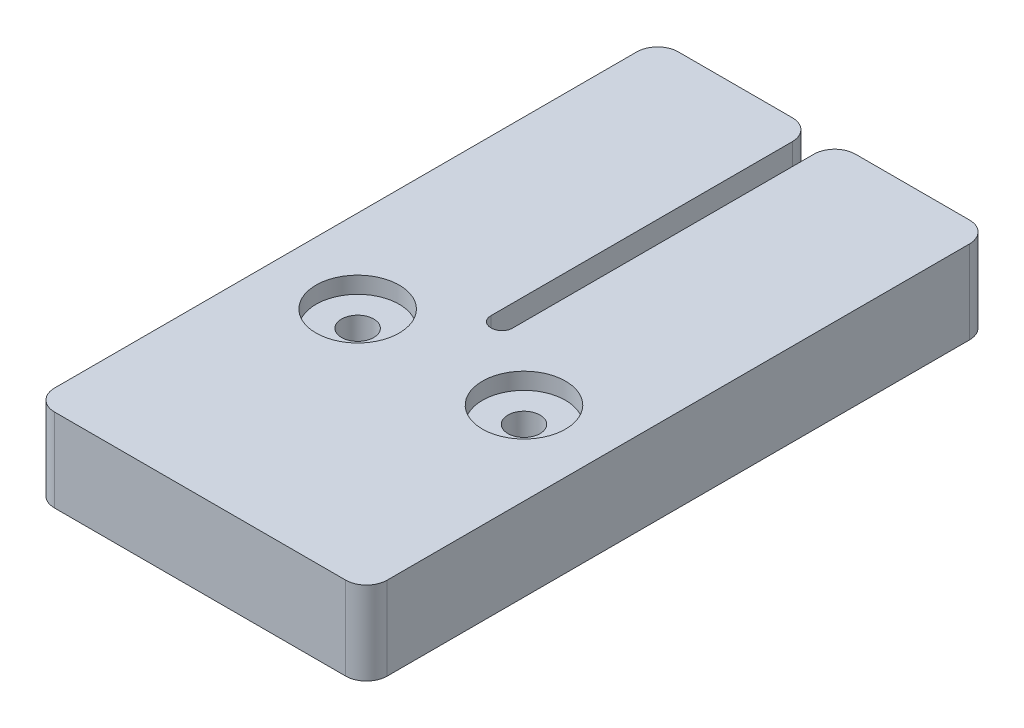
ISO-10303-21;
HEADER;
FILE_DESCRIPTION(('STEP AP214'),'2;1');
FILE_NAME('part.step','',(''),(''),'','','');
FILE_SCHEMA(('AUTOMOTIVE_DESIGN { 1 0 10303 214 1 1 1 1 }'));
ENDSEC;
DATA;
#1=APPLICATION_CONTEXT('core data for automotive mechanical design processes');
#2=APPLICATION_PROTOCOL_DEFINITION('international standard','automotive_design',2000,#1);
#3=PRODUCT_CONTEXT('',#1,'mechanical');
#4=PRODUCT('Part','Part','',(#3));
#5=PRODUCT_RELATED_PRODUCT_CATEGORY('part','',(#4));
#6=PRODUCT_DEFINITION_FORMATION('','',#4);
#7=PRODUCT_DEFINITION_CONTEXT('part definition',#1,'design');
#8=PRODUCT_DEFINITION('design','',#6,#7);
#9=PRODUCT_DEFINITION_SHAPE('','',#8);
#10=(LENGTH_UNIT() NAMED_UNIT(*) SI_UNIT(.MILLI.,.METRE.));
#11=(NAMED_UNIT(*) PLANE_ANGLE_UNIT() SI_UNIT($,.RADIAN.));
#12=(NAMED_UNIT(*) SI_UNIT($,.STERADIAN.) SOLID_ANGLE_UNIT());
#13=UNCERTAINTY_MEASURE_WITH_UNIT(LENGTH_MEASURE(1.E-05),#10,'distance_accuracy_value','');
#14=(GEOMETRIC_REPRESENTATION_CONTEXT(3) GLOBAL_UNCERTAINTY_ASSIGNED_CONTEXT((#13)) GLOBAL_UNIT_ASSIGNED_CONTEXT((#10,
#11,#12)) REPRESENTATION_CONTEXT('',''));
#15=CARTESIAN_POINT('',(0.,0.,0.));
#16=DIRECTION('',(0.,0.,1.));
#17=DIRECTION('',(1.,0.,0.));
#18=AXIS2_PLACEMENT_3D('',#15,#16,#17);
#19=CARTESIAN_POINT('',(12.7,12.7,-36.7538));
#20=DIRECTION('',(0.,-1.,0.));
#21=DIRECTION('',(0.,0.,-1.));
#22=AXIS2_PLACEMENT_3D('',#19,#20,#21);
#23=CYLINDRICAL_SURFACE('',#22,2.45745);
#24=CARTESIAN_POINT('',(12.7,0.,-36.7538));
#25=DIRECTION('',(0.,-1.,0.));
#26=DIRECTION('',(0.,0.,-1.));
#27=AXIS2_PLACEMENT_3D('',#24,#25,#26);
#28=CIRCLE('',#27,2.45745);
#29=CARTESIAN_POINT('',(12.7,0.,-39.21125));
#30=VERTEX_POINT('',#29);
#31=EDGE_CURVE('E294',#30,#30,#28,.T.);
#32=ORIENTED_EDGE('',*,*,#31,.T.);
#33=EDGE_LOOP('',(#32));
#34=FACE_BOUND('',#33,.T.);
#35=CARTESIAN_POINT('',(12.7,10.16,-36.7538));
#36=DIRECTION('',(0.,1.,0.));
#37=DIRECTION('',(0.,0.,1.));
#38=AXIS2_PLACEMENT_3D('',#35,#36,#37);
#39=CIRCLE('',#38,2.45745);
#40=CARTESIAN_POINT('',(12.7,10.16,-34.29635));
#41=VERTEX_POINT('',#40);
#42=EDGE_CURVE('E42',#41,#41,#39,.F.);
#43=ORIENTED_EDGE('',*,*,#42,.F.);
#44=EDGE_LOOP('',(#43));
#45=FACE_BOUND('',#44,.T.);
#46=ADVANCED_FACE('F38',(#34,#45),#23,.F.);
#47=CARTESIAN_POINT('',(-12.7,12.7,-36.7538));
#48=DIRECTION('',(0.,-1.,0.));
#49=DIRECTION('',(0.,0.,-1.));
#50=AXIS2_PLACEMENT_3D('',#47,#48,#49);
#51=CYLINDRICAL_SURFACE('',#50,2.45745);
#52=CARTESIAN_POINT('',(-12.7,0.,-36.7538));
#53=DIRECTION('',(0.,-1.,0.));
#54=DIRECTION('',(0.,0.,-1.));
#55=AXIS2_PLACEMENT_3D('',#52,#53,#54);
#56=CIRCLE('',#55,2.45745);
#57=CARTESIAN_POINT('',(-12.7,0.,-39.21125));
#58=VERTEX_POINT('',#57);
#59=EDGE_CURVE('E313',#58,#58,#56,.T.);
#60=ORIENTED_EDGE('',*,*,#59,.T.);
#61=EDGE_LOOP('',(#60));
#62=FACE_BOUND('',#61,.T.);
#63=CARTESIAN_POINT('',(-12.7,10.16,-36.7538));
#64=DIRECTION('',(0.,1.,0.));
#65=DIRECTION('',(0.,0.,1.));
#66=AXIS2_PLACEMENT_3D('',#63,#64,#65);
#67=CIRCLE('',#66,2.45745);
#68=CARTESIAN_POINT('',(-12.7,10.16,-34.29635));
#69=VERTEX_POINT('',#68);
#70=EDGE_CURVE('E284',#69,#69,#67,.F.);
#71=ORIENTED_EDGE('',*,*,#70,.F.);
#72=EDGE_LOOP('',(#71));
#73=FACE_BOUND('',#72,.T.);
#74=ADVANCED_FACE('F383',(#62,#73),#51,.F.);
#75=CARTESIAN_POINT('',(-25.4,12.7,-95.25));
#76=DIRECTION('',(1.,0.,0.));
#77=DIRECTION('',(0.,0.,-1.));
#78=AXIS2_PLACEMENT_3D('',#75,#76,#77);
#79=PLANE('',#78);
#80=DIRECTION('',(0.,0.,1.));
#81=VECTOR('',#80,1.);
#82=CARTESIAN_POINT('',(-25.4,12.7,-95.25));
#83=LINE('',#82,#81);
#84=CARTESIAN_POINT('',(-25.4,12.7,-92.075));
#85=VERTEX_POINT('',#84);
#86=CARTESIAN_POINT('',(-25.4,12.7,-3.175));
#87=VERTEX_POINT('',#86);
#88=EDGE_CURVE('E193',#85,#87,#83,.T.);
#89=ORIENTED_EDGE('',*,*,#88,.F.);
#90=DIRECTION('',(0.,-1.,0.));
#91=VECTOR('',#90,1.);
#92=CARTESIAN_POINT('',(-25.4,12.7,-92.075));
#93=LINE('',#92,#91);
#94=CARTESIAN_POINT('',(-25.4,0.,-92.075));
#95=VERTEX_POINT('',#94);
#96=EDGE_CURVE('E246',#85,#95,#93,.T.);
#97=ORIENTED_EDGE('',*,*,#96,.T.);
#98=DIRECTION('',(0.,0.,1.));
#99=VECTOR('',#98,1.);
#100=CARTESIAN_POINT('',(-25.4,0.,-95.25));
#101=LINE('',#100,#99);
#102=CARTESIAN_POINT('',(-25.4,0.,-3.175));
#103=VERTEX_POINT('',#102);
#104=EDGE_CURVE('E317',#95,#103,#101,.T.);
#105=ORIENTED_EDGE('',*,*,#104,.T.);
#106=DIRECTION('',(0.,-1.,0.));
#107=VECTOR('',#106,1.);
#108=CARTESIAN_POINT('',(-25.4,12.7,-3.175));
#109=LINE('',#108,#107);
#110=EDGE_CURVE('E243',#103,#87,#109,.F.);
#111=ORIENTED_EDGE('',*,*,#110,.T.);
#112=EDGE_LOOP('',(#89,#97,#105,#111));
#113=FACE_BOUND('',#112,.T.);
#114=ADVANCED_FACE('F389',(#113),#79,.F.);
#115=CARTESIAN_POINT('',(-25.4,12.7,0.));
#116=DIRECTION('',(0.,0.,-1.));
#117=DIRECTION('',(-1.,0.,0.));
#118=AXIS2_PLACEMENT_3D('',#115,#116,#117);
#119=PLANE('',#118);
#120=DIRECTION('',(1.,0.,0.));
#121=VECTOR('',#120,1.);
#122=CARTESIAN_POINT('',(-25.4,12.7,0.));
#123=LINE('',#122,#121);
#124=CARTESIAN_POINT('',(-22.225,12.7,0.));
#125=VERTEX_POINT('',#124);
#126=CARTESIAN_POINT('',(22.225,12.7,0.));
#127=VERTEX_POINT('',#126);
#128=EDGE_CURVE('E324',#125,#127,#123,.T.);
#129=ORIENTED_EDGE('',*,*,#128,.F.);
#130=DIRECTION('',(0.,-1.,0.));
#131=VECTOR('',#130,1.);
#132=CARTESIAN_POINT('',(-22.225,12.7,0.));
#133=LINE('',#132,#131);
#134=CARTESIAN_POINT('',(-22.225,0.,0.));
#135=VERTEX_POINT('',#134);
#136=EDGE_CURVE('E260',#125,#135,#133,.T.);
#137=ORIENTED_EDGE('',*,*,#136,.T.);
#138=DIRECTION('',(1.,0.,0.));
#139=VECTOR('',#138,1.);
#140=CARTESIAN_POINT('',(-25.4,0.,0.));
#141=LINE('',#140,#139);
#142=CARTESIAN_POINT('',(22.225,0.,0.));
#143=VERTEX_POINT('',#142);
#144=EDGE_CURVE('E351',#135,#143,#141,.T.);
#145=ORIENTED_EDGE('',*,*,#144,.T.);
#146=DIRECTION('',(0.,-1.,0.));
#147=VECTOR('',#146,1.);
#148=CARTESIAN_POINT('',(22.225,12.7,0.));
#149=LINE('',#148,#147);
#150=EDGE_CURVE('E257',#143,#127,#149,.F.);
#151=ORIENTED_EDGE('',*,*,#150,.T.);
#152=EDGE_LOOP('',(#129,#137,#145,#151));
#153=FACE_BOUND('',#152,.T.);
#154=ADVANCED_FACE('F380',(#153),#119,.F.);
#155=CARTESIAN_POINT('',(25.4,12.7,0.));
#156=DIRECTION('',(-1.,0.,0.));
#157=DIRECTION('',(0.,0.,1.));
#158=AXIS2_PLACEMENT_3D('',#155,#156,#157);
#159=PLANE('',#158);
#160=DIRECTION('',(0.,0.,-1.));
#161=VECTOR('',#160,1.);
#162=CARTESIAN_POINT('',(25.4,0.,0.));
#163=LINE('',#162,#161);
#164=CARTESIAN_POINT('',(25.4,0.,-3.175));
#165=VERTEX_POINT('',#164);
#166=CARTESIAN_POINT('',(25.4,0.,-92.075));
#167=VERTEX_POINT('',#166);
#168=EDGE_CURVE('E184',#165,#167,#163,.T.);
#169=ORIENTED_EDGE('',*,*,#168,.T.);
#170=DIRECTION('',(0.,-1.,0.));
#171=VECTOR('',#170,1.);
#172=CARTESIAN_POINT('',(25.4,12.7,-92.075));
#173=LINE('',#172,#171);
#174=CARTESIAN_POINT('',(25.4,12.7,-92.075));
#175=VERTEX_POINT('',#174);
#176=EDGE_CURVE('E254',#167,#175,#173,.F.);
#177=ORIENTED_EDGE('',*,*,#176,.T.);
#178=DIRECTION('',(0.,0.,-1.));
#179=VECTOR('',#178,1.);
#180=CARTESIAN_POINT('',(25.4,12.7,0.));
#181=LINE('',#180,#179);
#182=CARTESIAN_POINT('',(25.4,12.7,-3.175));
#183=VERTEX_POINT('',#182);
#184=EDGE_CURVE('E328',#183,#175,#181,.T.);
#185=ORIENTED_EDGE('',*,*,#184,.F.);
#186=DIRECTION('',(0.,-1.,0.));
#187=VECTOR('',#186,1.);
#188=CARTESIAN_POINT('',(25.4,12.7,-3.175));
#189=LINE('',#188,#187);
#190=EDGE_CURVE('E250',#183,#165,#189,.T.);
#191=ORIENTED_EDGE('',*,*,#190,.T.);
#192=EDGE_LOOP('',(#169,#177,#185,#191));
#193=FACE_BOUND('',#192,.T.);
#194=ADVANCED_FACE('F360',(#193),#159,.F.);
#195=CARTESIAN_POINT('',(25.4,12.7,-95.25));
#196=DIRECTION('',(0.,0.,1.));
#197=DIRECTION('',(1.,0.,0.));
#198=AXIS2_PLACEMENT_3D('',#195,#196,#197);
#199=PLANE('',#198);
#200=DIRECTION('',(-1.,0.,0.));
#201=VECTOR('',#200,1.);
#202=CARTESIAN_POINT('',(25.4,0.,-95.25));
#203=LINE('',#202,#201);
#204=CARTESIAN_POINT('',(22.225,0.,-95.25));
#205=VERTEX_POINT('',#204);
#206=CARTESIAN_POINT('',(4.826,0.,-95.25));
#207=VERTEX_POINT('',#206);
#208=EDGE_CURVE('E176',#205,#207,#203,.T.);
#209=ORIENTED_EDGE('',*,*,#208,.T.);
#210=DIRECTION('',(0.,-1.,0.));
#211=VECTOR('',#210,1.);
#212=CARTESIAN_POINT('',(4.826,12.7,-95.25));
#213=LINE('',#212,#211);
#214=CARTESIAN_POINT('',(4.826,12.7,-95.25));
#215=VERTEX_POINT('',#214);
#216=EDGE_CURVE('E159',#207,#215,#213,.F.);
#217=ORIENTED_EDGE('',*,*,#216,.T.);
#218=DIRECTION('',(-1.,0.,0.));
#219=VECTOR('',#218,1.);
#220=CARTESIAN_POINT('',(25.4,12.7,-95.25));
#221=LINE('',#220,#219);
#222=CARTESIAN_POINT('',(22.225,12.7,-95.25));
#223=VERTEX_POINT('',#222);
#224=EDGE_CURVE('E332',#223,#215,#221,.T.);
#225=ORIENTED_EDGE('',*,*,#224,.F.);
#226=DIRECTION('',(0.,-1.,0.));
#227=VECTOR('',#226,1.);
#228=CARTESIAN_POINT('',(22.225,12.7,-95.25));
#229=LINE('',#228,#227);
#230=EDGE_CURVE('E163',#223,#205,#229,.T.);
#231=ORIENTED_EDGE('',*,*,#230,.T.);
#232=EDGE_LOOP('',(#209,#217,#225,#231));
#233=FACE_BOUND('',#232,.T.);
#234=ADVANCED_FACE('F371',(#233),#199,.F.);
#235=CARTESIAN_POINT('',(1.65099999999999,12.7,-44.45));
#236=DIRECTION('',(1.,0.,0.));
#237=DIRECTION('',(0.,0.,-1.));
#238=AXIS2_PLACEMENT_3D('',#235,#236,#237);
#239=PLANE('',#238);
#240=DIRECTION('',(0.,0.,1.));
#241=VECTOR('',#240,1.);
#242=CARTESIAN_POINT('',(1.65099999999999,0.,-44.45));
#243=LINE('',#242,#241);
#244=CARTESIAN_POINT('',(1.651,0.,-92.075));
#245=VERTEX_POINT('',#244);
#246=CARTESIAN_POINT('',(1.65099999999999,0.,-46.0375));
#247=VERTEX_POINT('',#246);
#248=EDGE_CURVE('E167',#245,#247,#243,.T.);
#249=ORIENTED_EDGE('',*,*,#248,.T.);
#250=DIRECTION('',(0.,-1.,0.));
#251=VECTOR('',#250,1.);
#252=CARTESIAN_POINT('',(1.65099999999999,12.7,-46.0375));
#253=LINE('',#252,#251);
#254=CARTESIAN_POINT('',(1.65099999999999,12.7,-46.0375));
#255=VERTEX_POINT('',#254);
#256=EDGE_CURVE('E62',#247,#255,#253,.F.);
#257=ORIENTED_EDGE('',*,*,#256,.T.);
#258=DIRECTION('',(0.,0.,1.));
#259=VECTOR('',#258,1.);
#260=CARTESIAN_POINT('',(1.65099999999999,12.7,-44.45));
#261=LINE('',#260,#259);
#262=CARTESIAN_POINT('',(1.651,12.7,-92.075));
#263=VERTEX_POINT('',#262);
#264=EDGE_CURVE('E168',#263,#255,#261,.T.);
#265=ORIENTED_EDGE('',*,*,#264,.F.);
#266=DIRECTION('',(0.,-1.,0.));
#267=VECTOR('',#266,1.);
#268=CARTESIAN_POINT('',(1.651,12.7,-92.075));
#269=LINE('',#268,#267);
#270=EDGE_CURVE('E158',#263,#245,#269,.T.);
#271=ORIENTED_EDGE('',*,*,#270,.T.);
#272=EDGE_LOOP('',(#249,#257,#265,#271));
#273=FACE_BOUND('',#272,.T.);
#274=ADVANCED_FACE('F166',(#273),#239,.F.);
#275=CARTESIAN_POINT('',(-1.65099999999999,12.7,-44.45));
#276=DIRECTION('',(0.,0.,1.));
#277=DIRECTION('',(1.,0.,0.));
#278=AXIS2_PLACEMENT_3D('',#275,#276,#277);
#279=PLANE('',#278);
#280=DIRECTION('',(-1.,0.,0.));
#281=VECTOR('',#280,1.);
#282=CARTESIAN_POINT('',(-1.65099999999999,0.,-44.45));
#283=LINE('',#282,#281);
#284=CARTESIAN_POINT('',(0.0634999999999939,0.,-44.45));
#285=VERTEX_POINT('',#284);
#286=CARTESIAN_POINT('',(-0.0634999999999939,0.,-44.45));
#287=VERTEX_POINT('',#286);
#288=EDGE_CURVE('E175',#285,#287,#283,.T.);
#289=ORIENTED_EDGE('',*,*,#288,.T.);
#290=DIRECTION('',(0.,-1.,0.));
#291=VECTOR('',#290,1.);
#292=CARTESIAN_POINT('',(-0.0634999999999939,12.7,-44.45));
#293=LINE('',#292,#291);
#294=CARTESIAN_POINT('',(-0.0634999999999939,12.7,-44.45));
#295=VERTEX_POINT('',#294);
#296=EDGE_CURVE('E272',#287,#295,#293,.F.);
#297=ORIENTED_EDGE('',*,*,#296,.T.);
#298=DIRECTION('',(-1.,0.,0.));
#299=VECTOR('',#298,1.);
#300=CARTESIAN_POINT('',(-1.65099999999999,12.7,-44.45));
#301=LINE('',#300,#299);
#302=CARTESIAN_POINT('',(0.0634999999999939,12.7,-44.45));
#303=VERTEX_POINT('',#302);
#304=EDGE_CURVE('E338',#303,#295,#301,.T.);
#305=ORIENTED_EDGE('',*,*,#304,.F.);
#306=DIRECTION('',(0.,-1.,0.));
#307=VECTOR('',#306,1.);
#308=CARTESIAN_POINT('',(0.0634999999999939,0.,-44.45));
#309=LINE('',#308,#307);
#310=EDGE_CURVE('E268',#303,#285,#309,.T.);
#311=ORIENTED_EDGE('',*,*,#310,.T.);
#312=EDGE_LOOP('',(#289,#297,#305,#311));
#313=FACE_BOUND('',#312,.T.);
#314=ADVANCED_FACE('F378',(#313),#279,.F.);
#315=CARTESIAN_POINT('',(-1.651,12.7,-95.25));
#316=DIRECTION('',(-1.,0.,0.));
#317=DIRECTION('',(0.,0.,1.));
#318=AXIS2_PLACEMENT_3D('',#315,#316,#317);
#319=PLANE('',#318);
#320=DIRECTION('',(0.,0.,-1.));
#321=VECTOR('',#320,1.);
#322=CARTESIAN_POINT('',(-1.651,12.7,-95.25));
#323=LINE('',#322,#321);
#324=CARTESIAN_POINT('',(-1.65099999999999,12.7,-46.0375));
#325=VERTEX_POINT('',#324);
#326=CARTESIAN_POINT('',(-1.651,12.7,-92.075));
#327=VERTEX_POINT('',#326);
#328=EDGE_CURVE('E342',#325,#327,#323,.T.);
#329=ORIENTED_EDGE('',*,*,#328,.F.);
#330=DIRECTION('',(0.,-1.,0.));
#331=VECTOR('',#330,1.);
#332=CARTESIAN_POINT('',(-1.65099999999999,0.,-46.0375));
#333=LINE('',#332,#331);
#334=CARTESIAN_POINT('',(-1.65099999999999,0.,-46.0375));
#335=VERTEX_POINT('',#334);
#336=EDGE_CURVE('E264',#325,#335,#333,.T.);
#337=ORIENTED_EDGE('',*,*,#336,.T.);
#338=DIRECTION('',(0.,0.,-1.));
#339=VECTOR('',#338,1.);
#340=CARTESIAN_POINT('',(-1.651,0.,-95.25));
#341=LINE('',#340,#339);
#342=CARTESIAN_POINT('',(-1.651,0.,-92.075));
#343=VERTEX_POINT('',#342);
#344=EDGE_CURVE('E182',#335,#343,#341,.T.);
#345=ORIENTED_EDGE('',*,*,#344,.T.);
#346=DIRECTION('',(0.,-1.,0.));
#347=VECTOR('',#346,1.);
#348=CARTESIAN_POINT('',(-1.651,12.7,-92.075));
#349=LINE('',#348,#347);
#350=EDGE_CURVE('E239',#343,#327,#349,.F.);
#351=ORIENTED_EDGE('',*,*,#350,.T.);
#352=EDGE_LOOP('',(#329,#337,#345,#351));
#353=FACE_BOUND('',#352,.T.);
#354=ADVANCED_FACE('F404',(#353),#319,.F.);
#355=CARTESIAN_POINT('',(-1.651,12.7,-95.25));
#356=DIRECTION('',(0.,0.,1.));
#357=DIRECTION('',(1.,0.,0.));
#358=AXIS2_PLACEMENT_3D('',#355,#356,#357);
#359=PLANE('',#358);
#360=DIRECTION('',(-1.,0.,0.));
#361=VECTOR('',#360,1.);
#362=CARTESIAN_POINT('',(-1.651,12.7,-95.25));
#363=LINE('',#362,#361);
#364=CARTESIAN_POINT('',(-4.826,12.7,-95.25));
#365=VERTEX_POINT('',#364);
#366=CARTESIAN_POINT('',(-22.225,12.7,-95.25));
#367=VERTEX_POINT('',#366);
#368=EDGE_CURVE('E171',#365,#367,#363,.T.);
#369=ORIENTED_EDGE('',*,*,#368,.F.);
#370=DIRECTION('',(0.,-1.,0.));
#371=VECTOR('',#370,1.);
#372=CARTESIAN_POINT('',(-4.826,12.7,-95.25));
#373=LINE('',#372,#371);
#374=CARTESIAN_POINT('',(-4.826,0.,-95.25));
#375=VERTEX_POINT('',#374);
#376=EDGE_CURVE('E235',#365,#375,#373,.T.);
#377=ORIENTED_EDGE('',*,*,#376,.T.);
#378=DIRECTION('',(-1.,0.,0.));
#379=VECTOR('',#378,1.);
#380=CARTESIAN_POINT('',(-1.651,0.,-95.25));
#381=LINE('',#380,#379);
#382=CARTESIAN_POINT('',(-22.225,0.,-95.25));
#383=VERTEX_POINT('',#382);
#384=EDGE_CURVE('E190',#375,#383,#381,.T.);
#385=ORIENTED_EDGE('',*,*,#384,.T.);
#386=DIRECTION('',(0.,-1.,0.));
#387=VECTOR('',#386,1.);
#388=CARTESIAN_POINT('',(-22.225,12.7,-95.25));
#389=LINE('',#388,#387);
#390=EDGE_CURVE('E232',#383,#367,#389,.F.);
#391=ORIENTED_EDGE('',*,*,#390,.T.);
#392=EDGE_LOOP('',(#369,#377,#385,#391));
#393=FACE_BOUND('',#392,.T.);
#394=ADVANCED_FACE('F397',(#393),#359,.F.);
#395=CARTESIAN_POINT('',(0.,12.7,0.));
#396=DIRECTION('',(0.,1.,0.));
#397=DIRECTION('',(0.,0.,1.));
#398=AXIS2_PLACEMENT_3D('',#395,#396,#397);
#399=PLANE('',#398);
#400=CARTESIAN_POINT('',(12.7,12.7,-36.7538));
#401=DIRECTION('',(0.,1.,0.));
#402=DIRECTION('',(0.,0.,1.));
#403=AXIS2_PLACEMENT_3D('',#400,#401,#402);
#404=CIRCLE('',#403,6.35);
#405=CARTESIAN_POINT('',(12.7,12.7,-30.4038));
#406=VERTEX_POINT('',#405);
#407=EDGE_CURVE('E296',#406,#406,#404,.T.);
#408=ORIENTED_EDGE('',*,*,#407,.F.);
#409=EDGE_LOOP('',(#408));
#410=FACE_BOUND('',#409,.T.);
#411=CARTESIAN_POINT('',(-12.7,12.7,-36.7538));
#412=DIRECTION('',(0.,1.,0.));
#413=DIRECTION('',(0.,0.,1.));
#414=AXIS2_PLACEMENT_3D('',#411,#412,#413);
#415=CIRCLE('',#414,6.35);
#416=CARTESIAN_POINT('',(-12.7,12.7,-30.4038));
#417=VERTEX_POINT('',#416);
#418=EDGE_CURVE('E309',#417,#417,#415,.T.);
#419=ORIENTED_EDGE('',*,*,#418,.F.);
#420=EDGE_LOOP('',(#419));
#421=FACE_BOUND('',#420,.T.);
#422=ORIENTED_EDGE('',*,*,#224,.T.);
#423=CARTESIAN_POINT('',(4.826,12.7,-92.075));
#424=DIRECTION('',(0.,1.,0.));
#425=DIRECTION('',(0.,0.,1.));
#426=AXIS2_PLACEMENT_3D('',#423,#424,#425);
#427=CIRCLE('',#426,3.175);
#428=EDGE_CURVE('E229',#215,#263,#427,.T.);
#429=ORIENTED_EDGE('',*,*,#428,.T.);
#430=ORIENTED_EDGE('',*,*,#264,.T.);
#431=CARTESIAN_POINT('',(0.0634999999999939,12.7,-46.0375));
#432=DIRECTION('',(0.,1.,0.));
#433=DIRECTION('',(0.,0.,1.));
#434=AXIS2_PLACEMENT_3D('',#431,#432,#433);
#435=CIRCLE('',#434,1.5875);
#436=EDGE_CURVE('E11',#255,#303,#435,.F.);
#437=ORIENTED_EDGE('',*,*,#436,.T.);
#438=ORIENTED_EDGE('',*,*,#304,.T.);
#439=CARTESIAN_POINT('',(-0.0634999999999939,12.7,-46.0375));
#440=DIRECTION('',(0.,1.,0.));
#441=DIRECTION('',(0.,0.,1.));
#442=AXIS2_PLACEMENT_3D('',#439,#440,#441);
#443=CIRCLE('',#442,1.5875);
#444=EDGE_CURVE('E280',#295,#325,#443,.F.);
#445=ORIENTED_EDGE('',*,*,#444,.T.);
#446=ORIENTED_EDGE('',*,*,#328,.T.);
#447=CARTESIAN_POINT('',(-4.826,12.7,-92.075));
#448=DIRECTION('',(0.,1.,0.));
#449=DIRECTION('',(0.,0.,1.));
#450=AXIS2_PLACEMENT_3D('',#447,#448,#449);
#451=CIRCLE('',#450,3.175);
#452=EDGE_CURVE('E226',#327,#365,#451,.T.);
#453=ORIENTED_EDGE('',*,*,#452,.T.);
#454=ORIENTED_EDGE('',*,*,#368,.T.);
#455=CARTESIAN_POINT('',(-22.225,12.7,-92.075));
#456=DIRECTION('',(0.,1.,0.));
#457=DIRECTION('',(0.,0.,1.));
#458=AXIS2_PLACEMENT_3D('',#455,#456,#457);
#459=CIRCLE('',#458,3.175);
#460=EDGE_CURVE('E223',#367,#85,#459,.T.);
#461=ORIENTED_EDGE('',*,*,#460,.T.);
#462=ORIENTED_EDGE('',*,*,#88,.T.);
#463=CARTESIAN_POINT('',(-22.225,12.7,-3.175));
#464=DIRECTION('',(0.,1.,0.));
#465=DIRECTION('',(0.,0.,1.));
#466=AXIS2_PLACEMENT_3D('',#463,#464,#465);
#467=CIRCLE('',#466,3.175);
#468=EDGE_CURVE('E217',#87,#125,#467,.T.);
#469=ORIENTED_EDGE('',*,*,#468,.T.);
#470=ORIENTED_EDGE('',*,*,#128,.T.);
#471=CARTESIAN_POINT('',(22.225,12.7,-3.175));
#472=DIRECTION('',(0.,1.,0.));
#473=DIRECTION('',(0.,0.,1.));
#474=AXIS2_PLACEMENT_3D('',#471,#472,#473);
#475=CIRCLE('',#474,3.175);
#476=EDGE_CURVE('E214',#127,#183,#475,.T.);
#477=ORIENTED_EDGE('',*,*,#476,.T.);
#478=ORIENTED_EDGE('',*,*,#184,.T.);
#479=CARTESIAN_POINT('',(22.225,12.7,-92.075));
#480=DIRECTION('',(0.,1.,0.));
#481=DIRECTION('',(0.,0.,1.));
#482=AXIS2_PLACEMENT_3D('',#479,#480,#481);
#483=CIRCLE('',#482,3.175);
#484=EDGE_CURVE('E220',#175,#223,#483,.T.);
#485=ORIENTED_EDGE('',*,*,#484,.T.);
#486=EDGE_LOOP('',(#422,#429,#430,#437,#438,#445,#446,#453,#454,#461,#462,#469,#470,#477,#478,#485));
#487=FACE_BOUND('',#486,.T.);
#488=ADVANCED_FACE('F369',(#410,#421,#487),#399,.T.);
#489=CARTESIAN_POINT('',(0.,0.,0.));
#490=DIRECTION('',(0.,1.,0.));
#491=DIRECTION('',(0.,0.,1.));
#492=AXIS2_PLACEMENT_3D('',#489,#490,#491);
#493=PLANE('',#492);
#494=ORIENTED_EDGE('',*,*,#59,.F.);
#495=EDGE_LOOP('',(#494));
#496=FACE_BOUND('',#495,.T.);
#497=ORIENTED_EDGE('',*,*,#31,.F.);
#498=EDGE_LOOP('',(#497));
#499=FACE_BOUND('',#498,.T.);
#500=ORIENTED_EDGE('',*,*,#248,.F.);
#501=CARTESIAN_POINT('',(4.826,0.,-92.075));
#502=DIRECTION('',(0.,1.,0.));
#503=DIRECTION('',(0.,0.,1.));
#504=AXIS2_PLACEMENT_3D('',#501,#502,#503);
#505=CIRCLE('',#504,3.175);
#506=EDGE_CURVE('E154',#245,#207,#505,.F.);
#507=ORIENTED_EDGE('',*,*,#506,.T.);
#508=ORIENTED_EDGE('',*,*,#208,.F.);
#509=CARTESIAN_POINT('',(22.225,0.,-92.075));
#510=DIRECTION('',(0.,1.,0.));
#511=DIRECTION('',(0.,0.,1.));
#512=AXIS2_PLACEMENT_3D('',#509,#510,#511);
#513=CIRCLE('',#512,3.175);
#514=EDGE_CURVE('E200',#205,#167,#513,.F.);
#515=ORIENTED_EDGE('',*,*,#514,.T.);
#516=ORIENTED_EDGE('',*,*,#168,.F.);
#517=CARTESIAN_POINT('',(22.225,0.,-3.175));
#518=DIRECTION('',(0.,1.,0.));
#519=DIRECTION('',(0.,0.,1.));
#520=AXIS2_PLACEMENT_3D('',#517,#518,#519);
#521=CIRCLE('',#520,3.175);
#522=EDGE_CURVE('E170',#165,#143,#521,.F.);
#523=ORIENTED_EDGE('',*,*,#522,.T.);
#524=ORIENTED_EDGE('',*,*,#144,.F.);
#525=CARTESIAN_POINT('',(-22.225,0.,-3.175));
#526=DIRECTION('',(0.,1.,0.));
#527=DIRECTION('',(0.,0.,1.));
#528=AXIS2_PLACEMENT_3D('',#525,#526,#527);
#529=CIRCLE('',#528,3.175);
#530=EDGE_CURVE('E197',#135,#103,#529,.F.);
#531=ORIENTED_EDGE('',*,*,#530,.T.);
#532=ORIENTED_EDGE('',*,*,#104,.F.);
#533=CARTESIAN_POINT('',(-22.225,0.,-92.075));
#534=DIRECTION('',(0.,1.,0.));
#535=DIRECTION('',(0.,0.,1.));
#536=AXIS2_PLACEMENT_3D('',#533,#534,#535);
#537=CIRCLE('',#536,3.175);
#538=EDGE_CURVE('E203',#95,#383,#537,.F.);
#539=ORIENTED_EDGE('',*,*,#538,.T.);
#540=ORIENTED_EDGE('',*,*,#384,.F.);
#541=CARTESIAN_POINT('',(-4.826,0.,-92.075));
#542=DIRECTION('',(0.,1.,0.));
#543=DIRECTION('',(0.,0.,1.));
#544=AXIS2_PLACEMENT_3D('',#541,#542,#543);
#545=CIRCLE('',#544,3.175);
#546=EDGE_CURVE('E164',#375,#343,#545,.F.);
#547=ORIENTED_EDGE('',*,*,#546,.T.);
#548=ORIENTED_EDGE('',*,*,#344,.F.);
#549=CARTESIAN_POINT('',(-0.0634999999999939,0.,-46.0375));
#550=DIRECTION('',(0.,1.,0.));
#551=DIRECTION('',(0.,0.,1.));
#552=AXIS2_PLACEMENT_3D('',#549,#550,#551);
#553=CIRCLE('',#552,1.5875);
#554=EDGE_CURVE('E277',#335,#287,#553,.T.);
#555=ORIENTED_EDGE('',*,*,#554,.T.);
#556=ORIENTED_EDGE('',*,*,#288,.F.);
#557=CARTESIAN_POINT('',(0.0634999999999939,0.,-46.0375));
#558=DIRECTION('',(0.,1.,0.));
#559=DIRECTION('',(0.,0.,1.));
#560=AXIS2_PLACEMENT_3D('',#557,#558,#559);
#561=CIRCLE('',#560,1.5875);
#562=EDGE_CURVE('E48',#285,#247,#561,.T.);
#563=ORIENTED_EDGE('',*,*,#562,.T.);
#564=EDGE_LOOP('',(#500,#507,#508,#515,#516,#523,#524,#531,#532,#539,#540,#547,#548,#555,#556,#563));
#565=FACE_BOUND('',#564,.T.);
#566=ADVANCED_FACE('F173',(#496,#499,#565),#493,.F.);
#567=CARTESIAN_POINT('',(4.826,12.7,-92.075));
#568=DIRECTION('',(0.,-1.,0.));
#569=DIRECTION('',(0.,0.,-1.));
#570=AXIS2_PLACEMENT_3D('',#567,#568,#569);
#571=CYLINDRICAL_SURFACE('',#570,3.175);
#572=ORIENTED_EDGE('',*,*,#428,.F.);
#573=ORIENTED_EDGE('',*,*,#216,.F.);
#574=ORIENTED_EDGE('',*,*,#506,.F.);
#575=ORIENTED_EDGE('',*,*,#270,.F.);
#576=EDGE_LOOP('',(#572,#573,#574,#575));
#577=FACE_BOUND('',#576,.T.);
#578=ADVANCED_FACE('F157',(#577),#571,.T.);
#579=CARTESIAN_POINT('',(-4.826,12.7,-92.075));
#580=DIRECTION('',(0.,-1.,0.));
#581=DIRECTION('',(0.,0.,-1.));
#582=AXIS2_PLACEMENT_3D('',#579,#580,#581);
#583=CYLINDRICAL_SURFACE('',#582,3.175);
#584=ORIENTED_EDGE('',*,*,#452,.F.);
#585=ORIENTED_EDGE('',*,*,#350,.F.);
#586=ORIENTED_EDGE('',*,*,#546,.F.);
#587=ORIENTED_EDGE('',*,*,#376,.F.);
#588=EDGE_LOOP('',(#584,#585,#586,#587));
#589=FACE_BOUND('',#588,.T.);
#590=ADVANCED_FACE('F426',(#589),#583,.T.);
#591=CARTESIAN_POINT('',(-22.225,12.7,-92.075));
#592=DIRECTION('',(0.,-1.,0.));
#593=DIRECTION('',(0.,0.,-1.));
#594=AXIS2_PLACEMENT_3D('',#591,#592,#593);
#595=CYLINDRICAL_SURFACE('',#594,3.175);
#596=ORIENTED_EDGE('',*,*,#460,.F.);
#597=ORIENTED_EDGE('',*,*,#390,.F.);
#598=ORIENTED_EDGE('',*,*,#538,.F.);
#599=ORIENTED_EDGE('',*,*,#96,.F.);
#600=EDGE_LOOP('',(#596,#597,#598,#599));
#601=FACE_BOUND('',#600,.T.);
#602=ADVANCED_FACE('F432',(#601),#595,.T.);
#603=CARTESIAN_POINT('',(22.225,12.7,-92.075));
#604=DIRECTION('',(0.,-1.,0.));
#605=DIRECTION('',(0.,0.,-1.));
#606=AXIS2_PLACEMENT_3D('',#603,#604,#605);
#607=CYLINDRICAL_SURFACE('',#606,3.175);
#608=ORIENTED_EDGE('',*,*,#484,.F.);
#609=ORIENTED_EDGE('',*,*,#176,.F.);
#610=ORIENTED_EDGE('',*,*,#514,.F.);
#611=ORIENTED_EDGE('',*,*,#230,.F.);
#612=EDGE_LOOP('',(#608,#609,#610,#611));
#613=FACE_BOUND('',#612,.T.);
#614=ADVANCED_FACE('F365',(#613),#607,.T.);
#615=CARTESIAN_POINT('',(-22.225,12.7,-3.175));
#616=DIRECTION('',(0.,-1.,0.));
#617=DIRECTION('',(0.,0.,-1.));
#618=AXIS2_PLACEMENT_3D('',#615,#616,#617);
#619=CYLINDRICAL_SURFACE('',#618,3.175);
#620=ORIENTED_EDGE('',*,*,#468,.F.);
#621=ORIENTED_EDGE('',*,*,#110,.F.);
#622=ORIENTED_EDGE('',*,*,#530,.F.);
#623=ORIENTED_EDGE('',*,*,#136,.F.);
#624=EDGE_LOOP('',(#620,#621,#622,#623));
#625=FACE_BOUND('',#624,.T.);
#626=ADVANCED_FACE('F440',(#625),#619,.T.);
#627=CARTESIAN_POINT('',(22.225,12.7,-3.175));
#628=DIRECTION('',(0.,-1.,0.));
#629=DIRECTION('',(0.,0.,-1.));
#630=AXIS2_PLACEMENT_3D('',#627,#628,#629);
#631=CYLINDRICAL_SURFACE('',#630,3.175);
#632=ORIENTED_EDGE('',*,*,#476,.F.);
#633=ORIENTED_EDGE('',*,*,#150,.F.);
#634=ORIENTED_EDGE('',*,*,#522,.F.);
#635=ORIENTED_EDGE('',*,*,#190,.F.);
#636=EDGE_LOOP('',(#632,#633,#634,#635));
#637=FACE_BOUND('',#636,.T.);
#638=ADVANCED_FACE('F448',(#637),#631,.T.);
#639=CARTESIAN_POINT('',(-0.0634999999999939,12.7,-46.0375));
#640=DIRECTION('',(0.,1.,0.));
#641=DIRECTION('',(0.,0.,1.));
#642=AXIS2_PLACEMENT_3D('',#639,#640,#641);
#643=CYLINDRICAL_SURFACE('',#642,1.5875);
#644=ORIENTED_EDGE('',*,*,#444,.F.);
#645=ORIENTED_EDGE('',*,*,#296,.F.);
#646=ORIENTED_EDGE('',*,*,#554,.F.);
#647=ORIENTED_EDGE('',*,*,#336,.F.);
#648=EDGE_LOOP('',(#644,#645,#646,#647));
#649=FACE_BOUND('',#648,.T.);
#650=ADVANCED_FACE('F418',(#649),#643,.F.);
#651=CARTESIAN_POINT('',(0.0634999999999939,12.7,-46.0375));
#652=DIRECTION('',(0.,1.,0.));
#653=DIRECTION('',(0.,0.,1.));
#654=AXIS2_PLACEMENT_3D('',#651,#652,#653);
#655=CYLINDRICAL_SURFACE('',#654,1.5875);
#656=ORIENTED_EDGE('',*,*,#436,.F.);
#657=ORIENTED_EDGE('',*,*,#256,.F.);
#658=ORIENTED_EDGE('',*,*,#562,.F.);
#659=ORIENTED_EDGE('',*,*,#310,.F.);
#660=EDGE_LOOP('',(#656,#657,#658,#659));
#661=FACE_BOUND('',#660,.T.);
#662=ADVANCED_FACE('F40',(#661),#655,.F.);
#663=CARTESIAN_POINT('',(-12.7,10.16,-36.7538));
#664=DIRECTION('',(0.,1.,0.));
#665=DIRECTION('',(0.,0.,1.));
#666=AXIS2_PLACEMENT_3D('',#663,#664,#665);
#667=PLANE('',#666);
#668=CARTESIAN_POINT('',(-12.7,10.16,-36.7538));
#669=DIRECTION('',(0.,1.,0.));
#670=DIRECTION('',(0.,0.,1.));
#671=AXIS2_PLACEMENT_3D('',#668,#669,#670);
#672=CIRCLE('',#671,6.35);
#673=CARTESIAN_POINT('',(-12.7,10.16,-30.4038));
#674=VERTEX_POINT('',#673);
#675=EDGE_CURVE('E303',#674,#674,#672,.T.);
#676=ORIENTED_EDGE('',*,*,#675,.T.);
#677=EDGE_LOOP('',(#676));
#678=FACE_BOUND('',#677,.T.);
#679=ORIENTED_EDGE('',*,*,#70,.T.);
#680=EDGE_LOOP('',(#679));
#681=FACE_BOUND('',#680,.T.);
#682=ADVANCED_FACE('F566',(#678,#681),#667,.T.);
#683=CARTESIAN_POINT('',(-12.7,10.16,-36.7538));
#684=DIRECTION('',(0.,1.,0.));
#685=DIRECTION('',(0.,0.,1.));
#686=AXIS2_PLACEMENT_3D('',#683,#684,#685);
#687=CYLINDRICAL_SURFACE('',#686,6.35);
#688=ORIENTED_EDGE('',*,*,#675,.F.);
#689=EDGE_LOOP('',(#688));
#690=FACE_BOUND('',#689,.T.);
#691=ORIENTED_EDGE('',*,*,#418,.T.);
#692=EDGE_LOOP('',(#691));
#693=FACE_BOUND('',#692,.T.);
#694=ADVANCED_FACE('F574',(#690,#693),#687,.F.);
#695=CARTESIAN_POINT('',(12.7,10.16,-36.7538));
#696=DIRECTION('',(0.,1.,0.));
#697=DIRECTION('',(0.,0.,1.));
#698=AXIS2_PLACEMENT_3D('',#695,#696,#697);
#699=PLANE('',#698);
#700=CARTESIAN_POINT('',(12.7,10.16,-36.7538));
#701=DIRECTION('',(0.,1.,0.));
#702=DIRECTION('',(0.,0.,1.));
#703=AXIS2_PLACEMENT_3D('',#700,#701,#702);
#704=CIRCLE('',#703,6.35);
#705=CARTESIAN_POINT('',(12.7,10.16,-30.4038));
#706=VERTEX_POINT('',#705);
#707=EDGE_CURVE('E287',#706,#706,#704,.T.);
#708=ORIENTED_EDGE('',*,*,#707,.T.);
#709=EDGE_LOOP('',(#708));
#710=FACE_BOUND('',#709,.T.);
#711=ORIENTED_EDGE('',*,*,#42,.T.);
#712=EDGE_LOOP('',(#711));
#713=FACE_BOUND('',#712,.T.);
#714=ADVANCED_FACE('F584',(#710,#713),#699,.T.);
#715=CARTESIAN_POINT('',(12.7,10.16,-36.7538));
#716=DIRECTION('',(0.,1.,0.));
#717=DIRECTION('',(0.,0.,1.));
#718=AXIS2_PLACEMENT_3D('',#715,#716,#717);
#719=CYLINDRICAL_SURFACE('',#718,6.35);
#720=ORIENTED_EDGE('',*,*,#707,.F.);
#721=EDGE_LOOP('',(#720));
#722=FACE_BOUND('',#721,.T.);
#723=ORIENTED_EDGE('',*,*,#407,.T.);
#724=EDGE_LOOP('',(#723));
#725=FACE_BOUND('',#724,.T.);
#726=ADVANCED_FACE('F593',(#722,#725),#719,.F.);
#727=CLOSED_SHELL('',(#46,#74,#114,#154,#194,#234,#274,#314,#354,#394,#488,#566,#578,#590,#602,
#614,#626,#638,#650,#662,#682,#694,#714,#726));
#728=MANIFOLD_SOLID_BREP('B2',#727);
#729=ADVANCED_BREP_SHAPE_REPRESENTATION('',(#18,#728),#14);
#730=SHAPE_DEFINITION_REPRESENTATION(#9,#729);
ENDSEC;
END-ISO-10303-21;
